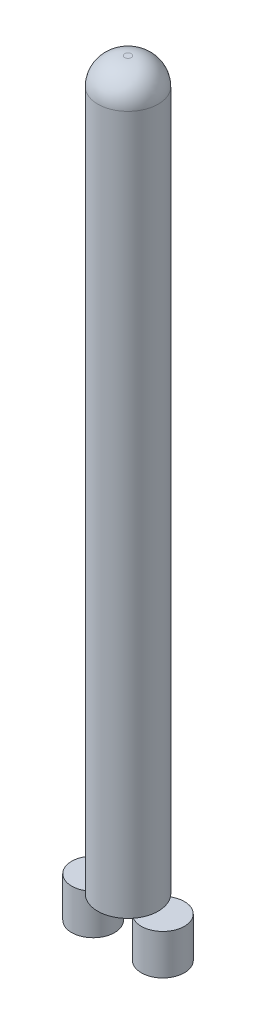
ISO-10303-21;
HEADER;
FILE_DESCRIPTION(('STEP AP214'),'2;1');
FILE_NAME('part.step','',(''),(''),'','','');
FILE_SCHEMA(('AUTOMOTIVE_DESIGN { 1 0 10303 214 1 1 1 1 }'));
ENDSEC;
DATA;
#1=APPLICATION_CONTEXT('core data for automotive mechanical design processes');
#2=APPLICATION_PROTOCOL_DEFINITION('international standard','automotive_design',2000,#1);
#3=PRODUCT_CONTEXT('',#1,'mechanical');
#4=PRODUCT('Part','Part','',(#3));
#5=PRODUCT_RELATED_PRODUCT_CATEGORY('part','',(#4));
#6=PRODUCT_DEFINITION_FORMATION('','',#4);
#7=PRODUCT_DEFINITION_CONTEXT('part definition',#1,'design');
#8=PRODUCT_DEFINITION('design','',#6,#7);
#9=PRODUCT_DEFINITION_SHAPE('','',#8);
#10=(LENGTH_UNIT() NAMED_UNIT(*) SI_UNIT(.MILLI.,.METRE.));
#11=(NAMED_UNIT(*) PLANE_ANGLE_UNIT() SI_UNIT($,.RADIAN.));
#12=(NAMED_UNIT(*) SI_UNIT($,.STERADIAN.) SOLID_ANGLE_UNIT());
#13=UNCERTAINTY_MEASURE_WITH_UNIT(LENGTH_MEASURE(1.E-05),#10,'distance_accuracy_value','');
#14=(GEOMETRIC_REPRESENTATION_CONTEXT(3) GLOBAL_UNCERTAINTY_ASSIGNED_CONTEXT((#13)) GLOBAL_UNIT_ASSIGNED_CONTEXT((#10,
#11,#12)) REPRESENTATION_CONTEXT('',''));
#15=CARTESIAN_POINT('',(0.,0.,0.));
#16=DIRECTION('',(0.,0.,1.));
#17=DIRECTION('',(1.,0.,0.));
#18=AXIS2_PLACEMENT_3D('',#15,#16,#17);
#19=CARTESIAN_POINT('',(-51.8508403101005,-60.,0.));
#20=DIRECTION('',(0.,1.,0.));
#21=DIRECTION('',(0.,0.,1.));
#22=AXIS2_PLACEMENT_3D('',#19,#20,#21);
#23=CYLINDRICAL_SURFACE('',#22,32.);
#24=CARTESIAN_POINT('',(-51.8508403101005,-60.,0.));
#25=DIRECTION('',(0.,1.,0.));
#26=DIRECTION('',(0.,0.,-1.));
#27=AXIS2_PLACEMENT_3D('',#24,#25,#26);
#28=CIRCLE('',#27,32.);
#29=CARTESIAN_POINT('',(-51.8508403101005,-60.,-32.));
#30=VERTEX_POINT('',#29);
#31=EDGE_CURVE('E56',#30,#30,#28,.T.);
#32=ORIENTED_EDGE('',*,*,#31,.T.);
#33=EDGE_LOOP('',(#32));
#34=FACE_BOUND('',#33,.T.);
#35=CARTESIAN_POINT('',(-51.8508403101005,0.,0.));
#36=DIRECTION('',(0.,1.,0.));
#37=DIRECTION('',(0.,0.,-1.));
#38=AXIS2_PLACEMENT_3D('',#35,#36,#37);
#39=CIRCLE('',#38,32.);
#40=CARTESIAN_POINT('',(-51.8508403101005,0.,-32.));
#41=VERTEX_POINT('',#40);
#42=EDGE_CURVE('E11',#41,#41,#39,.T.);
#43=ORIENTED_EDGE('',*,*,#42,.F.);
#44=EDGE_LOOP('',(#43));
#45=FACE_BOUND('',#44,.T.);
#46=ADVANCED_FACE('F52',(#34,#45),#23,.T.);
#47=CARTESIAN_POINT('',(-51.8508403101005,-60.,0.));
#48=DIRECTION('',(0.,-1.,0.));
#49=DIRECTION('',(0.,0.,-1.));
#50=AXIS2_PLACEMENT_3D('',#47,#48,#49);
#51=PLANE('',#50);
#52=ORIENTED_EDGE('',*,*,#31,.F.);
#53=EDGE_LOOP('',(#52));
#54=FACE_BOUND('',#53,.T.);
#55=ADVANCED_FACE('F54',(#54),#51,.T.);
#56=CARTESIAN_POINT('',(-51.8508403101005,0.,0.));
#57=DIRECTION('',(0.,-1.,0.));
#58=DIRECTION('',(0.,0.,-1.));
#59=AXIS2_PLACEMENT_3D('',#56,#57,#58);
#60=PLANE('',#59);
#61=ORIENTED_EDGE('',*,*,#42,.T.);
#62=EDGE_LOOP('',(#61));
#63=FACE_BOUND('',#62,.T.);
#64=ADVANCED_FACE('F68',(#63),#60,.F.);
#65=CLOSED_SHELL('',(#46,#55,#64));
#66=MANIFOLD_SOLID_BREP('B2',#65);
#67=CARTESIAN_POINT('',(51.8508403101005,-60.,0.));
#68=DIRECTION('',(0.,1.,0.));
#69=DIRECTION('',(0.,0.,1.));
#70=AXIS2_PLACEMENT_3D('',#67,#68,#69);
#71=CYLINDRICAL_SURFACE('',#70,32.);
#72=CARTESIAN_POINT('',(51.8508403101005,-60.,0.));
#73=DIRECTION('',(0.,1.,0.));
#74=DIRECTION('',(0.,0.,1.));
#75=AXIS2_PLACEMENT_3D('',#72,#73,#74);
#76=CIRCLE('',#75,32.);
#77=CARTESIAN_POINT('',(51.8508403101005,-60.,32.));
#78=VERTEX_POINT('',#77);
#79=EDGE_CURVE('E51',#78,#78,#76,.T.);
#80=ORIENTED_EDGE('',*,*,#79,.T.);
#81=EDGE_LOOP('',(#80));
#82=FACE_BOUND('',#81,.T.);
#83=CARTESIAN_POINT('',(51.8508403101005,0.,0.));
#84=DIRECTION('',(0.,1.,0.));
#85=DIRECTION('',(0.,0.,1.));
#86=AXIS2_PLACEMENT_3D('',#83,#84,#85);
#87=CIRCLE('',#86,32.);
#88=CARTESIAN_POINT('',(51.8508403101005,0.,32.));
#89=VERTEX_POINT('',#88);
#90=EDGE_CURVE('E103',#89,#89,#87,.T.);
#91=ORIENTED_EDGE('',*,*,#90,.F.);
#92=EDGE_LOOP('',(#91));
#93=FACE_BOUND('',#92,.T.);
#94=ADVANCED_FACE('F100',(#82,#93),#71,.T.);
#95=CARTESIAN_POINT('',(51.8508403101005,-60.,0.));
#96=DIRECTION('',(0.,1.,0.));
#97=DIRECTION('',(0.,0.,1.));
#98=AXIS2_PLACEMENT_3D('',#95,#96,#97);
#99=PLANE('',#98);
#100=ORIENTED_EDGE('',*,*,#79,.F.);
#101=EDGE_LOOP('',(#100));
#102=FACE_BOUND('',#101,.T.);
#103=ADVANCED_FACE('F115',(#102),#99,.F.);
#104=CARTESIAN_POINT('',(51.8508403101005,0.,0.));
#105=DIRECTION('',(0.,1.,0.));
#106=DIRECTION('',(0.,0.,1.));
#107=AXIS2_PLACEMENT_3D('',#104,#105,#106);
#108=PLANE('',#107);
#109=ORIENTED_EDGE('',*,*,#90,.T.);
#110=EDGE_LOOP('',(#109));
#111=FACE_BOUND('',#110,.T.);
#112=ADVANCED_FACE('F112',(#111),#108,.T.);
#113=CLOSED_SHELL('',(#94,#103,#112));
#114=MANIFOLD_SOLID_BREP('B6',#113);
#115=CARTESIAN_POINT('',(0.,0.,0.));
#116=DIRECTION('',(0.,1.,0.));
#117=DIRECTION('',(0.,0.,1.));
#118=AXIS2_PLACEMENT_3D('',#115,#116,#117);
#119=PLANE('',#118);
#120=CARTESIAN_POINT('',(0.,0.,0.));
#121=DIRECTION('',(0.,1.,0.));
#122=DIRECTION('',(0.,0.,1.));
#123=AXIS2_PLACEMENT_3D('',#120,#121,#122);
#124=CIRCLE('',#123,45.);
#125=CARTESIAN_POINT('',(0.,0.,45.));
#126=VERTEX_POINT('',#125);
#127=EDGE_CURVE('E152',#126,#126,#124,.T.);
#128=ORIENTED_EDGE('',*,*,#127,.F.);
#129=EDGE_LOOP('',(#128));
#130=FACE_BOUND('',#129,.T.);
#131=CARTESIAN_POINT('',(0.,0.,0.));
#132=DIRECTION('',(0.,1.,0.));
#133=DIRECTION('',(0.,0.,1.));
#134=AXIS2_PLACEMENT_3D('',#131,#132,#133);
#135=CIRCLE('',#134,42.);
#136=CARTESIAN_POINT('',(0.,0.,42.));
#137=VERTEX_POINT('',#136);
#138=EDGE_CURVE('E156',#137,#137,#135,.T.);
#139=ORIENTED_EDGE('',*,*,#138,.T.);
#140=EDGE_LOOP('',(#139));
#141=FACE_BOUND('',#140,.T.);
#142=ADVANCED_FACE('F141',(#130,#141),#119,.F.);
#143=CARTESIAN_POINT('',(0.,1000.,0.));
#144=DIRECTION('',(0.,-1.,0.));
#145=DIRECTION('',(0.,0.,-1.));
#146=AXIS2_PLACEMENT_3D('',#143,#144,#145);
#147=CYLINDRICAL_SURFACE('',#146,45.);
#148=CARTESIAN_POINT('',(0.,1040.,0.));
#149=DIRECTION('',(0.,1.,0.));
#150=DIRECTION('',(0.,0.,1.));
#151=AXIS2_PLACEMENT_3D('',#148,#149,#150);
#152=CIRCLE('',#151,45.);
#153=CARTESIAN_POINT('',(0.,1040.,45.));
#154=VERTEX_POINT('',#153);
#155=EDGE_CURVE('E99',#154,#154,#152,.F.);
#156=ORIENTED_EDGE('',*,*,#155,.T.);
#157=EDGE_LOOP('',(#156));
#158=FACE_BOUND('',#157,.T.);
#159=ORIENTED_EDGE('',*,*,#127,.T.);
#160=EDGE_LOOP('',(#159));
#161=FACE_BOUND('',#160,.T.);
#162=ADVANCED_FACE('F178',(#158,#161),#147,.T.);
#163=CARTESIAN_POINT('',(0.,1000.,0.));
#164=DIRECTION('',(0.,-1.,0.));
#165=DIRECTION('',(0.,0.,-1.));
#166=AXIS2_PLACEMENT_3D('',#163,#164,#165);
#167=CYLINDRICAL_SURFACE('',#166,42.);
#168=CARTESIAN_POINT('',(0.,1000.,0.));
#169=DIRECTION('',(0.,1.,0.));
#170=DIRECTION('',(0.,0.,1.));
#171=AXIS2_PLACEMENT_3D('',#168,#169,#170);
#172=CIRCLE('',#171,42.);
#173=CARTESIAN_POINT('',(0.,1000.,42.));
#174=VERTEX_POINT('',#173);
#175=EDGE_CURVE('E161',#174,#174,#172,.T.);
#176=ORIENTED_EDGE('',*,*,#175,.T.);
#177=EDGE_LOOP('',(#176));
#178=FACE_BOUND('',#177,.T.);
#179=ORIENTED_EDGE('',*,*,#138,.F.);
#180=EDGE_LOOP('',(#179));
#181=FACE_BOUND('',#180,.T.);
#182=ADVANCED_FACE('F165',(#178,#181),#167,.F.);
#183=CARTESIAN_POINT('',(0.,1000.,0.));
#184=DIRECTION('',(0.,1.,0.));
#185=DIRECTION('',(0.,0.,1.));
#186=AXIS2_PLACEMENT_3D('',#183,#184,#185);
#187=PLANE('',#186);
#188=ORIENTED_EDGE('',*,*,#175,.F.);
#189=EDGE_LOOP('',(#188));
#190=FACE_BOUND('',#189,.T.);
#191=ADVANCED_FACE('F168',(#190),#187,.F.);
#192=CARTESIAN_POINT('',(0.,1080.,0.));
#193=DIRECTION('',(0.,1.,0.));
#194=DIRECTION('',(0.,0.,1.));
#195=AXIS2_PLACEMENT_3D('',#192,#193,#194);
#196=PLANE('',#195);
#197=CARTESIAN_POINT('',(0.,1080.,0.));
#198=DIRECTION('',(0.,1.,0.));
#199=DIRECTION('',(0.,0.,1.));
#200=AXIS2_PLACEMENT_3D('',#197,#198,#199);
#201=CIRCLE('',#200,5.);
#202=CARTESIAN_POINT('',(0.,1080.,5.));
#203=VERTEX_POINT('',#202);
#204=EDGE_CURVE('E148',#203,#203,#201,.T.);
#205=ORIENTED_EDGE('',*,*,#204,.T.);
#206=EDGE_LOOP('',(#205));
#207=FACE_BOUND('',#206,.T.);
#208=ADVANCED_FACE('F170',(#207),#196,.T.);
#209=CARTESIAN_POINT('',(0.,1040.,0.));
#210=DIRECTION('',(0.,1.,0.));
#211=DIRECTION('',(0.,0.,1.));
#212=AXIS2_PLACEMENT_3D('',#209,#210,#211);
#213=DEGENERATE_TOROIDAL_SURFACE('',#212,5.,40.,.T.);
#214=ORIENTED_EDGE('',*,*,#155,.F.);
#215=EDGE_LOOP('',(#214));
#216=FACE_BOUND('',#215,.T.);
#217=ORIENTED_EDGE('',*,*,#204,.F.);
#218=EDGE_LOOP('',(#217));
#219=FACE_BOUND('',#218,.T.);
#220=ADVANCED_FACE('F143',(#216,#219),#213,.T.);
#221=CLOSED_SHELL('',(#142,#162,#182,#191,#208,#220));
#222=MANIFOLD_SOLID_BREP('B46',#221);
#223=ADVANCED_BREP_SHAPE_REPRESENTATION('',(#18,#66,#114,#222),#14);
#224=SHAPE_DEFINITION_REPRESENTATION(#9,#223);
ENDSEC;
END-ISO-10303-21;
